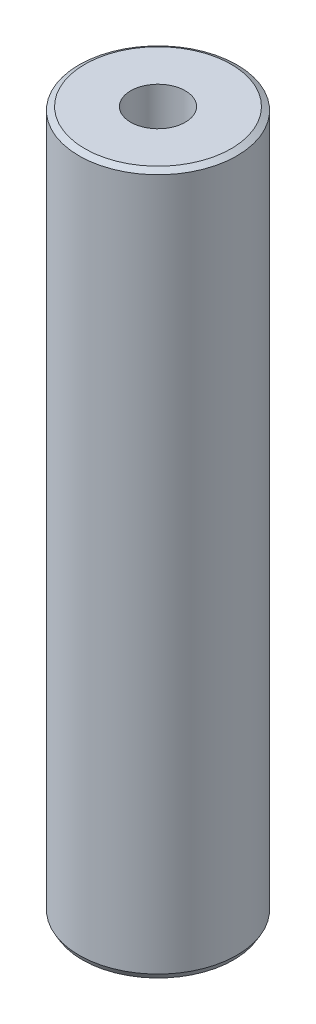
ISO-10303-21;
HEADER;
FILE_DESCRIPTION(('STEP AP214'),'2;1');
FILE_NAME('part.step','',(''),(''),'','','');
FILE_SCHEMA(('AUTOMOTIVE_DESIGN { 1 0 10303 214 1 1 1 1 }'));
ENDSEC;
DATA;
#1=APPLICATION_CONTEXT('core data for automotive mechanical design processes');
#2=APPLICATION_PROTOCOL_DEFINITION('international standard','automotive_design',2000,#1);
#3=PRODUCT_CONTEXT('',#1,'mechanical');
#4=PRODUCT('Part','Part','',(#3));
#5=PRODUCT_RELATED_PRODUCT_CATEGORY('part','',(#4));
#6=PRODUCT_DEFINITION_FORMATION('','',#4);
#7=PRODUCT_DEFINITION_CONTEXT('part definition',#1,'design');
#8=PRODUCT_DEFINITION('design','',#6,#7);
#9=PRODUCT_DEFINITION_SHAPE('','',#8);
#10=(LENGTH_UNIT() NAMED_UNIT(*) SI_UNIT(.MILLI.,.METRE.));
#11=(NAMED_UNIT(*) PLANE_ANGLE_UNIT() SI_UNIT($,.RADIAN.));
#12=(NAMED_UNIT(*) SI_UNIT($,.STERADIAN.) SOLID_ANGLE_UNIT());
#13=UNCERTAINTY_MEASURE_WITH_UNIT(LENGTH_MEASURE(1.E-05),#10,'distance_accuracy_value','');
#14=(GEOMETRIC_REPRESENTATION_CONTEXT(3) GLOBAL_UNCERTAINTY_ASSIGNED_CONTEXT((#13)) GLOBAL_UNIT_ASSIGNED_CONTEXT((#10,
#11,#12)) REPRESENTATION_CONTEXT('',''));
#15=CARTESIAN_POINT('',(0.,0.,0.));
#16=DIRECTION('',(0.,0.,1.));
#17=DIRECTION('',(1.,0.,0.));
#18=AXIS2_PLACEMENT_3D('',#15,#16,#17);
#19=CARTESIAN_POINT('',(0.,266.582401217039,0.));
#20=DIRECTION('',(0.,-1.,0.));
#21=DIRECTION('',(0.,0.,-1.));
#22=AXIS2_PLACEMENT_3D('',#19,#20,#21);
#23=CYLINDRICAL_SURFACE('',#22,30.);
#24=CARTESIAN_POINT('',(0.,265.320743010717,0.));
#25=DIRECTION('',(0.,1.,0.));
#26=DIRECTION('',(0.,0.,1.));
#27=AXIS2_PLACEMENT_3D('',#24,#25,#26);
#28=CIRCLE('',#27,30.);
#29=CARTESIAN_POINT('',(0.,265.320743010717,30.));
#30=VERTEX_POINT('',#29);
#31=EDGE_CURVE('E50',#30,#30,#28,.F.);
#32=ORIENTED_EDGE('',*,*,#31,.T.);
#33=EDGE_LOOP('',(#32));
#34=FACE_BOUND('',#33,.T.);
#35=CARTESIAN_POINT('',(0.,2.18525611513704,0.));
#36=DIRECTION('',(0.,1.,0.));
#37=DIRECTION('',(0.,0.,1.));
#38=AXIS2_PLACEMENT_3D('',#35,#36,#37);
#39=CIRCLE('',#38,30.);
#40=CARTESIAN_POINT('',(0.,2.18525611513704,30.));
#41=VERTEX_POINT('',#40);
#42=EDGE_CURVE('E51',#41,#41,#39,.T.);
#43=ORIENTED_EDGE('',*,*,#42,.T.);
#44=EDGE_LOOP('',(#43));
#45=FACE_BOUND('',#44,.T.);
#46=ADVANCED_FACE('F39',(#34,#45),#23,.T.);
#47=CARTESIAN_POINT('',(0.,266.582401217039,0.));
#48=DIRECTION('',(0.,1.,0.));
#49=DIRECTION('',(0.,0.,1.));
#50=AXIS2_PLACEMENT_3D('',#47,#48,#49);
#51=PLANE('',#50);
#52=CARTESIAN_POINT('',(0.,266.582401217039,0.));
#53=DIRECTION('',(0.,1.,0.));
#54=DIRECTION('',(0.,0.,1.));
#55=AXIS2_PLACEMENT_3D('',#52,#53,#54);
#56=CIRCLE('',#55,27.814743884863);
#57=CARTESIAN_POINT('',(0.,266.582401217039,27.814743884863));
#58=VERTEX_POINT('',#57);
#59=EDGE_CURVE('E54',#58,#58,#56,.T.);
#60=ORIENTED_EDGE('',*,*,#59,.T.);
#61=EDGE_LOOP('',(#60));
#62=FACE_BOUND('',#61,.T.);
#63=CARTESIAN_POINT('',(0.,266.582401217039,0.));
#64=DIRECTION('',(0.,1.,0.));
#65=DIRECTION('',(0.,0.,1.));
#66=AXIS2_PLACEMENT_3D('',#63,#64,#65);
#67=CIRCLE('',#66,10.3800757647158);
#68=CARTESIAN_POINT('',(0.,266.582401217039,10.3800757647158));
#69=VERTEX_POINT('',#68);
#70=EDGE_CURVE('E58',#69,#69,#67,.T.);
#71=ORIENTED_EDGE('',*,*,#70,.F.);
#72=EDGE_LOOP('',(#71));
#73=FACE_BOUND('',#72,.T.);
#74=ADVANCED_FACE('F69',(#62,#73),#51,.T.);
#75=CARTESIAN_POINT('',(0.,0.,0.));
#76=DIRECTION('',(0.,1.,0.));
#77=DIRECTION('',(0.,0.,1.));
#78=AXIS2_PLACEMENT_3D('',#75,#76,#77);
#79=PLANE('',#78);
#80=CARTESIAN_POINT('',(0.,0.,0.));
#81=DIRECTION('',(0.,1.,0.));
#82=DIRECTION('',(0.,0.,1.));
#83=AXIS2_PLACEMENT_3D('',#80,#81,#82);
#84=CIRCLE('',#83,28.7383417936773);
#85=CARTESIAN_POINT('',(0.,0.,28.7383417936773));
#86=VERTEX_POINT('',#85);
#87=EDGE_CURVE('E10',#86,#86,#84,.F.);
#88=ORIENTED_EDGE('',*,*,#87,.T.);
#89=EDGE_LOOP('',(#88));
#90=FACE_BOUND('',#89,.T.);
#91=CARTESIAN_POINT('',(0.,0.,0.));
#92=DIRECTION('',(0.,1.,0.));
#93=DIRECTION('',(0.,0.,1.));
#94=AXIS2_PLACEMENT_3D('',#91,#92,#93);
#95=CIRCLE('',#94,10.3800757647158);
#96=CARTESIAN_POINT('',(0.,0.,10.3800757647158));
#97=VERTEX_POINT('',#96);
#98=EDGE_CURVE('E63',#97,#97,#95,.T.);
#99=ORIENTED_EDGE('',*,*,#98,.T.);
#100=EDGE_LOOP('',(#99));
#101=FACE_BOUND('',#100,.T.);
#102=ADVANCED_FACE('F75',(#90,#101),#79,.F.);
#103=CARTESIAN_POINT('',(0.,266.582401217039,0.));
#104=DIRECTION('',(0.,-1.,0.));
#105=DIRECTION('',(0.,0.,-1.));
#106=AXIS2_PLACEMENT_3D('',#103,#104,#105);
#107=CYLINDRICAL_SURFACE('',#106,10.3800757647158);
#108=ORIENTED_EDGE('',*,*,#70,.T.);
#109=EDGE_LOOP('',(#108));
#110=FACE_BOUND('',#109,.T.);
#111=ORIENTED_EDGE('',*,*,#98,.F.);
#112=EDGE_LOOP('',(#111));
#113=FACE_BOUND('',#112,.T.);
#114=ADVANCED_FACE('F70',(#110,#113),#107,.F.);
#115=CARTESIAN_POINT('',(0.,266.582401217039,0.));
#116=DIRECTION('',(0.,-1.,0.));
#117=DIRECTION('',(0.,0.,-1.));
#118=AXIS2_PLACEMENT_3D('',#115,#116,#117);
#119=CONICAL_SURFACE('',#118,27.814743884863,1.0471975511966);
#120=ORIENTED_EDGE('',*,*,#31,.F.);
#121=EDGE_LOOP('',(#120));
#122=FACE_BOUND('',#121,.T.);
#123=ORIENTED_EDGE('',*,*,#59,.F.);
#124=EDGE_LOOP('',(#123));
#125=FACE_BOUND('',#124,.T.);
#126=ADVANCED_FACE('F81',(#122,#125),#119,.T.);
#127=CARTESIAN_POINT('',(0.,2.18525611513704,0.));
#128=DIRECTION('',(0.,1.,0.));
#129=DIRECTION('',(0.,0.,1.));
#130=AXIS2_PLACEMENT_3D('',#127,#128,#129);
#131=CONICAL_SURFACE('',#130,30.,0.523598775598302);
#132=ORIENTED_EDGE('',*,*,#87,.F.);
#133=EDGE_LOOP('',(#132));
#134=FACE_BOUND('',#133,.T.);
#135=ORIENTED_EDGE('',*,*,#42,.F.);
#136=EDGE_LOOP('',(#135));
#137=FACE_BOUND('',#136,.T.);
#138=ADVANCED_FACE('F45',(#134,#137),#131,.T.);
#139=CLOSED_SHELL('',(#46,#74,#102,#114,#126,#138));
#140=MANIFOLD_SOLID_BREP('B2',#139);
#141=ADVANCED_BREP_SHAPE_REPRESENTATION('',(#18,#140),#14);
#142=SHAPE_DEFINITION_REPRESENTATION(#9,#141);
ENDSEC;
END-ISO-10303-21;
